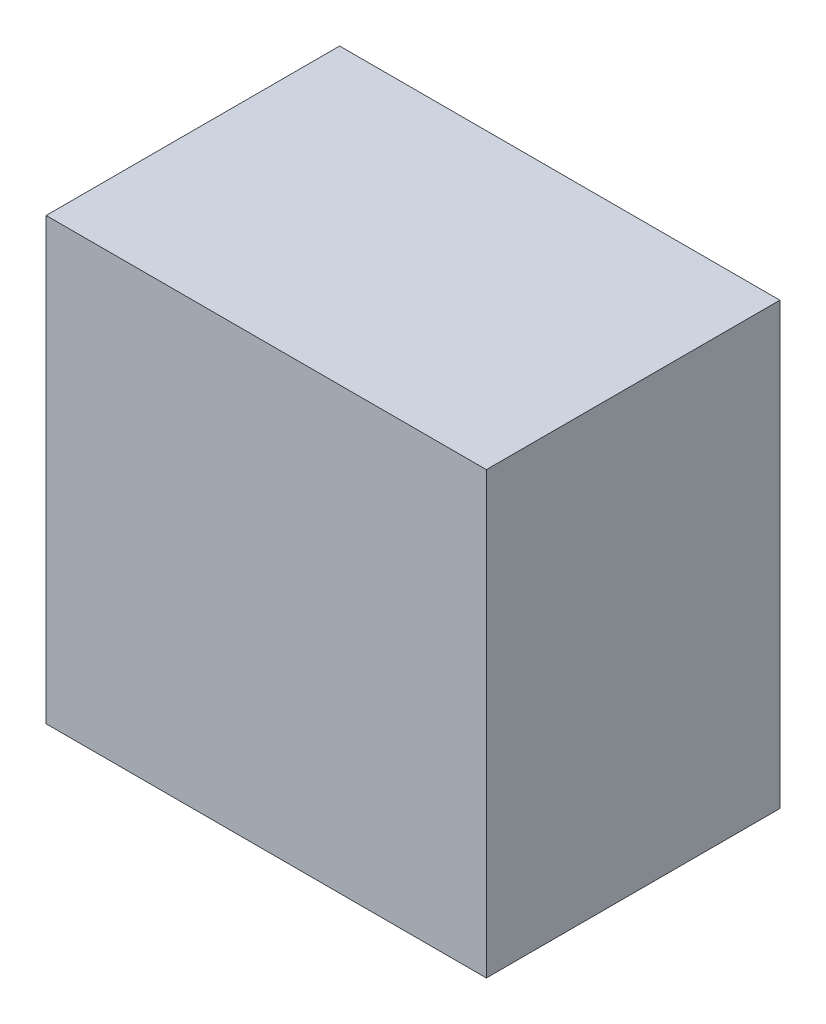
ISO-10303-21;
HEADER;
FILE_DESCRIPTION(('STEP AP214'),'2;1');
FILE_NAME('part.step','',(''),(''),'','','');
FILE_SCHEMA(('AUTOMOTIVE_DESIGN { 1 0 10303 214 1 1 1 1 }'));
ENDSEC;
DATA;
#1=APPLICATION_CONTEXT('core data for automotive mechanical design processes');
#2=APPLICATION_PROTOCOL_DEFINITION('international standard','automotive_design',2000,#1);
#3=PRODUCT_CONTEXT('',#1,'mechanical');
#4=PRODUCT('Part','Part','',(#3));
#5=PRODUCT_RELATED_PRODUCT_CATEGORY('part','',(#4));
#6=PRODUCT_DEFINITION_FORMATION('','',#4);
#7=PRODUCT_DEFINITION_CONTEXT('part definition',#1,'design');
#8=PRODUCT_DEFINITION('design','',#6,#7);
#9=PRODUCT_DEFINITION_SHAPE('','',#8);
#10=(LENGTH_UNIT() NAMED_UNIT(*) SI_UNIT(.MILLI.,.METRE.));
#11=(NAMED_UNIT(*) PLANE_ANGLE_UNIT() SI_UNIT($,.RADIAN.));
#12=(NAMED_UNIT(*) SI_UNIT($,.STERADIAN.) SOLID_ANGLE_UNIT());
#13=UNCERTAINTY_MEASURE_WITH_UNIT(LENGTH_MEASURE(1.E-05),#10,'distance_accuracy_value','');
#14=(GEOMETRIC_REPRESENTATION_CONTEXT(3) GLOBAL_UNCERTAINTY_ASSIGNED_CONTEXT((#13)) GLOBAL_UNIT_ASSIGNED_CONTEXT((#10,
#11,#12)) REPRESENTATION_CONTEXT('',''));
#15=CARTESIAN_POINT('',(0.,0.,0.));
#16=DIRECTION('',(0.,0.,1.));
#17=DIRECTION('',(1.,0.,0.));
#18=AXIS2_PLACEMENT_3D('',#15,#16,#17);
#19=CARTESIAN_POINT('',(0.,76.2,0.));
#20=DIRECTION('',(1.,0.,0.));
#21=DIRECTION('',(0.,0.,-1.));
#22=AXIS2_PLACEMENT_3D('',#19,#20,#21);
#23=PLANE('',#22);
#24=DIRECTION('',(0.,0.,1.));
#25=VECTOR('',#24,1.);
#26=CARTESIAN_POINT('',(0.,0.,0.));
#27=LINE('',#26,#25);
#28=CARTESIAN_POINT('',(0.,0.,-50.8));
#29=VERTEX_POINT('',#28);
#30=CARTESIAN_POINT('',(0.,0.,0.));
#31=VERTEX_POINT('',#30);
#32=EDGE_CURVE('E96',#29,#31,#27,.T.);
#33=ORIENTED_EDGE('',*,*,#32,.T.);
#34=DIRECTION('',(0.,-1.,0.));
#35=VECTOR('',#34,1.);
#36=CARTESIAN_POINT('',(0.,76.2,0.));
#37=LINE('',#36,#35);
#38=CARTESIAN_POINT('',(0.,76.2,0.));
#39=VERTEX_POINT('',#38);
#40=EDGE_CURVE('E11',#39,#31,#37,.T.);
#41=ORIENTED_EDGE('',*,*,#40,.F.);
#42=DIRECTION('',(0.,0.,1.));
#43=VECTOR('',#42,1.);
#44=CARTESIAN_POINT('',(0.,76.2,0.));
#45=LINE('',#44,#43);
#46=CARTESIAN_POINT('',(0.,76.2,-50.8));
#47=VERTEX_POINT('',#46);
#48=EDGE_CURVE('E84',#47,#39,#45,.T.);
#49=ORIENTED_EDGE('',*,*,#48,.F.);
#50=DIRECTION('',(0.,-1.,0.));
#51=VECTOR('',#50,1.);
#52=CARTESIAN_POINT('',(0.,76.2,-50.8));
#53=LINE('',#52,#51);
#54=EDGE_CURVE('E92',#47,#29,#53,.T.);
#55=ORIENTED_EDGE('',*,*,#54,.T.);
#56=EDGE_LOOP('',(#33,#41,#49,#55));
#57=FACE_BOUND('',#56,.T.);
#58=ADVANCED_FACE('F33',(#57),#23,.F.);
#59=CARTESIAN_POINT('',(0.,76.2,0.));
#60=DIRECTION('',(0.,0.,-1.));
#61=DIRECTION('',(-1.,0.,0.));
#62=AXIS2_PLACEMENT_3D('',#59,#60,#61);
#63=PLANE('',#62);
#64=DIRECTION('',(1.,0.,0.));
#65=VECTOR('',#64,1.);
#66=CARTESIAN_POINT('',(0.,0.,0.));
#67=LINE('',#66,#65);
#68=CARTESIAN_POINT('',(76.2,0.,0.));
#69=VERTEX_POINT('',#68);
#70=EDGE_CURVE('E88',#31,#69,#67,.T.);
#71=ORIENTED_EDGE('',*,*,#70,.T.);
#72=DIRECTION('',(0.,-1.,0.));
#73=VECTOR('',#72,1.);
#74=CARTESIAN_POINT('',(76.2,76.2,0.));
#75=LINE('',#74,#73);
#76=CARTESIAN_POINT('',(76.2,76.2,0.));
#77=VERTEX_POINT('',#76);
#78=EDGE_CURVE('E41',#77,#69,#75,.T.);
#79=ORIENTED_EDGE('',*,*,#78,.F.);
#80=DIRECTION('',(1.,0.,0.));
#81=VECTOR('',#80,1.);
#82=CARTESIAN_POINT('',(0.,76.2,0.));
#83=LINE('',#82,#81);
#84=EDGE_CURVE('E79',#39,#77,#83,.T.);
#85=ORIENTED_EDGE('',*,*,#84,.F.);
#86=ORIENTED_EDGE('',*,*,#40,.T.);
#87=EDGE_LOOP('',(#71,#79,#85,#86));
#88=FACE_BOUND('',#87,.T.);
#89=ADVANCED_FACE('F87',(#88),#63,.F.);
#90=CARTESIAN_POINT('',(76.2,76.2,0.));
#91=DIRECTION('',(-1.,0.,0.));
#92=DIRECTION('',(0.,0.,1.));
#93=AXIS2_PLACEMENT_3D('',#90,#91,#92);
#94=PLANE('',#93);
#95=DIRECTION('',(0.,0.,-1.));
#96=VECTOR('',#95,1.);
#97=CARTESIAN_POINT('',(76.2,0.,0.));
#98=LINE('',#97,#96);
#99=CARTESIAN_POINT('',(76.2,0.,-50.8));
#100=VERTEX_POINT('',#99);
#101=EDGE_CURVE('E66',#69,#100,#98,.T.);
#102=ORIENTED_EDGE('',*,*,#101,.T.);
#103=DIRECTION('',(0.,-1.,0.));
#104=VECTOR('',#103,1.);
#105=CARTESIAN_POINT('',(76.2,76.2,-50.8));
#106=LINE('',#105,#104);
#107=CARTESIAN_POINT('',(76.2,76.2,-50.8));
#108=VERTEX_POINT('',#107);
#109=EDGE_CURVE('E89',#108,#100,#106,.T.);
#110=ORIENTED_EDGE('',*,*,#109,.F.);
#111=DIRECTION('',(0.,0.,-1.));
#112=VECTOR('',#111,1.);
#113=CARTESIAN_POINT('',(76.2,76.2,0.));
#114=LINE('',#113,#112);
#115=EDGE_CURVE('E82',#77,#108,#114,.T.);
#116=ORIENTED_EDGE('',*,*,#115,.F.);
#117=ORIENTED_EDGE('',*,*,#78,.T.);
#118=EDGE_LOOP('',(#102,#110,#116,#117));
#119=FACE_BOUND('',#118,.T.);
#120=ADVANCED_FACE('F90',(#119),#94,.F.);
#121=CARTESIAN_POINT('',(0.,76.2,-50.8));
#122=DIRECTION('',(0.,0.,1.));
#123=DIRECTION('',(1.,0.,0.));
#124=AXIS2_PLACEMENT_3D('',#121,#122,#123);
#125=PLANE('',#124);
#126=DIRECTION('',(-1.,0.,0.));
#127=VECTOR('',#126,1.);
#128=CARTESIAN_POINT('',(0.,0.,-50.8));
#129=LINE('',#128,#127);
#130=EDGE_CURVE('E72',#100,#29,#129,.T.);
#131=ORIENTED_EDGE('',*,*,#130,.T.);
#132=ORIENTED_EDGE('',*,*,#54,.F.);
#133=DIRECTION('',(-1.,0.,0.));
#134=VECTOR('',#133,1.);
#135=CARTESIAN_POINT('',(0.,76.2,-50.8));
#136=LINE('',#135,#134);
#137=EDGE_CURVE('E49',#108,#47,#136,.T.);
#138=ORIENTED_EDGE('',*,*,#137,.F.);
#139=ORIENTED_EDGE('',*,*,#109,.T.);
#140=EDGE_LOOP('',(#131,#132,#138,#139));
#141=FACE_BOUND('',#140,.T.);
#142=ADVANCED_FACE('F103',(#141),#125,.F.);
#143=CARTESIAN_POINT('',(0.,76.2,-50.8));
#144=DIRECTION('',(0.,-1.,0.));
#145=DIRECTION('',(0.,0.,-1.));
#146=AXIS2_PLACEMENT_3D('',#143,#144,#145);
#147=PLANE('',#146);
#148=ORIENTED_EDGE('',*,*,#48,.T.);
#149=ORIENTED_EDGE('',*,*,#84,.T.);
#150=ORIENTED_EDGE('',*,*,#115,.T.);
#151=ORIENTED_EDGE('',*,*,#137,.T.);
#152=EDGE_LOOP('',(#148,#149,#150,#151));
#153=FACE_BOUND('',#152,.T.);
#154=ADVANCED_FACE('F80',(#153),#147,.F.);
#155=CARTESIAN_POINT('',(0.,0.,-50.8));
#156=DIRECTION('',(0.,-1.,0.));
#157=DIRECTION('',(0.,0.,-1.));
#158=AXIS2_PLACEMENT_3D('',#155,#156,#157);
#159=PLANE('',#158);
#160=ORIENTED_EDGE('',*,*,#32,.F.);
#161=ORIENTED_EDGE('',*,*,#130,.F.);
#162=ORIENTED_EDGE('',*,*,#101,.F.);
#163=ORIENTED_EDGE('',*,*,#70,.F.);
#164=EDGE_LOOP('',(#160,#161,#162,#163));
#165=FACE_BOUND('',#164,.T.);
#166=ADVANCED_FACE('F106',(#165),#159,.T.);
#167=CLOSED_SHELL('',(#58,#89,#120,#142,#154,#166));
#168=MANIFOLD_SOLID_BREP('B2',#167);
#169=ADVANCED_BREP_SHAPE_REPRESENTATION('',(#18,#168),#14);
#170=SHAPE_DEFINITION_REPRESENTATION(#9,#169);
ENDSEC;
END-ISO-10303-21;
